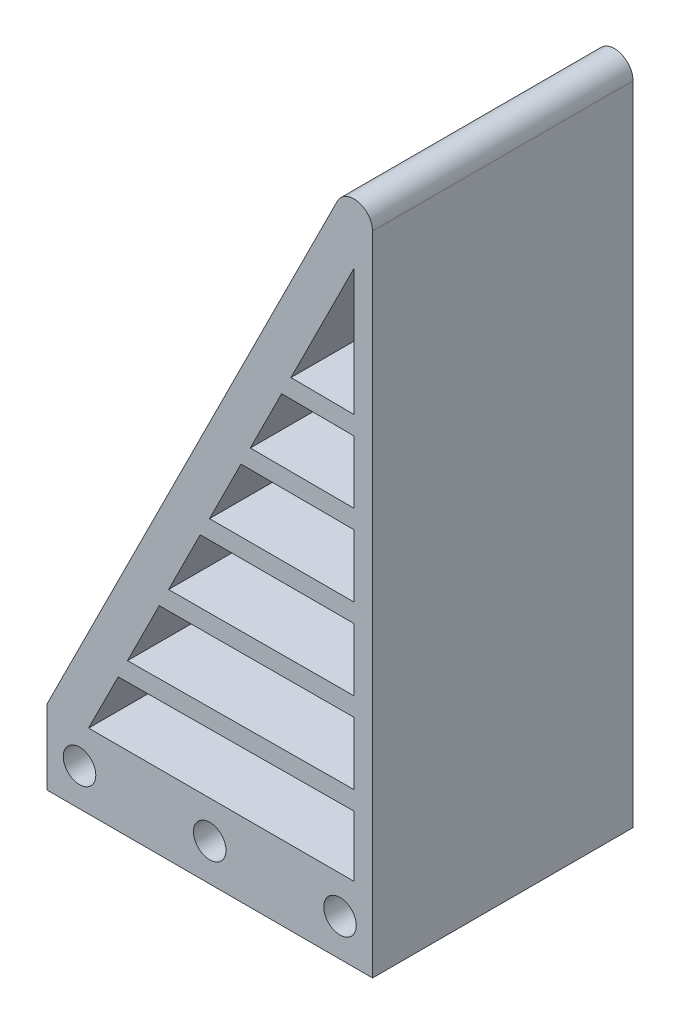
ISO-10303-21;
HEADER;
FILE_DESCRIPTION(('STEP AP214'),'2;1');
FILE_NAME('part.step','',(''),(''),'','','');
FILE_SCHEMA(('AUTOMOTIVE_DESIGN { 1 0 10303 214 1 1 1 1 }'));
ENDSEC;
DATA;
#1=APPLICATION_CONTEXT('core data for automotive mechanical design processes');
#2=APPLICATION_PROTOCOL_DEFINITION('international standard','automotive_design',2000,#1);
#3=PRODUCT_CONTEXT('',#1,'mechanical');
#4=PRODUCT('Part','Part','',(#3));
#5=PRODUCT_RELATED_PRODUCT_CATEGORY('part','',(#4));
#6=PRODUCT_DEFINITION_FORMATION('','',#4);
#7=PRODUCT_DEFINITION_CONTEXT('part definition',#1,'design');
#8=PRODUCT_DEFINITION('design','',#6,#7);
#9=PRODUCT_DEFINITION_SHAPE('','',#8);
#10=(LENGTH_UNIT() NAMED_UNIT(*) SI_UNIT(.MILLI.,.METRE.));
#11=(NAMED_UNIT(*) PLANE_ANGLE_UNIT() SI_UNIT($,.RADIAN.));
#12=(NAMED_UNIT(*) SI_UNIT($,.STERADIAN.) SOLID_ANGLE_UNIT());
#13=UNCERTAINTY_MEASURE_WITH_UNIT(LENGTH_MEASURE(1.E-05),#10,'distance_accuracy_value','');
#14=(GEOMETRIC_REPRESENTATION_CONTEXT(3) GLOBAL_UNCERTAINTY_ASSIGNED_CONTEXT((#13)) GLOBAL_UNIT_ASSIGNED_CONTEXT((#10,
#11,#12)) REPRESENTATION_CONTEXT('',''));
#15=CARTESIAN_POINT('',(0.,0.,0.));
#16=DIRECTION('',(0.,0.,1.));
#17=DIRECTION('',(1.,0.,0.));
#18=AXIS2_PLACEMENT_3D('',#15,#16,#17);
#19=CARTESIAN_POINT('',(15.5,61.0557280900009,0.));
#20=DIRECTION('',(-0.894427190999916,0.447213595499958,0.));
#21=DIRECTION('',(-0.447213595499958,-0.894427190999916,0.));
#22=AXIS2_PLACEMENT_3D('',#19,#20,#21);
#23=PLANE('',#22);
#24=DIRECTION('',(-0.447213595499958,-0.894427190999916,0.));
#25=VECTOR('',#24,1.);
#26=CARTESIAN_POINT('',(15.5,61.0557280900009,28.));
#27=LINE('',#26,#25);
#28=CARTESIAN_POINT('',(15.5,61.0557280900009,28.));
#29=VERTEX_POINT('',#28);
#30=CARTESIAN_POINT('',(8.72607274420883,47.5078735784185,28.));
#31=VERTEX_POINT('',#30);
#32=EDGE_CURVE('E454',#29,#31,#27,.T.);
#33=ORIENTED_EDGE('',*,*,#32,.T.);
#34=DIRECTION('',(0.,0.,1.));
#35=VECTOR('',#34,1.);
#36=CARTESIAN_POINT('',(8.72607274420883,47.5078735784185,-25.439951767214));
#37=LINE('',#36,#35);
#38=CARTESIAN_POINT('',(8.72607274420883,47.5078735784185,0.));
#39=VERTEX_POINT('',#38);
#40=EDGE_CURVE('E827',#39,#31,#37,.T.);
#41=ORIENTED_EDGE('',*,*,#40,.F.);
#42=DIRECTION('',(-0.447213595499958,-0.894427190999916,0.));
#43=VECTOR('',#42,1.);
#44=CARTESIAN_POINT('',(15.5,61.0557280900009,0.));
#45=LINE('',#44,#43);
#46=CARTESIAN_POINT('',(15.5,61.0557280900009,0.));
#47=VERTEX_POINT('',#46);
#48=EDGE_CURVE('E428',#47,#39,#45,.T.);
#49=ORIENTED_EDGE('',*,*,#48,.F.);
#50=DIRECTION('',(0.,0.,1.));
#51=VECTOR('',#50,1.);
#52=CARTESIAN_POINT('',(15.5,61.0557280900009,0.));
#53=LINE('',#52,#51);
#54=EDGE_CURVE('E277',#47,#29,#53,.T.);
#55=ORIENTED_EDGE('',*,*,#54,.T.);
#56=EDGE_LOOP('',(#33,#41,#49,#55));
#57=FACE_BOUND('',#56,.T.);
#58=ADVANCED_FACE('F41',(#57),#23,.F.);
#59=CARTESIAN_POINT('',(15.5,4.,0.));
#60=DIRECTION('',(1.,0.,0.));
#61=DIRECTION('',(0.,0.,-1.));
#62=AXIS2_PLACEMENT_3D('',#59,#60,#61);
#63=PLANE('',#62);
#64=DIRECTION('',(0.,1.,0.));
#65=VECTOR('',#64,1.);
#66=CARTESIAN_POINT('',(15.5,4.,0.));
#67=LINE('',#66,#65);
#68=CARTESIAN_POINT('',(15.5,47.460581876541,0.));
#69=VERTEX_POINT('',#68);
#70=EDGE_CURVE('E247',#69,#47,#67,.T.);
#71=ORIENTED_EDGE('',*,*,#70,.F.);
#72=DIRECTION('',(0.,0.,1.));
#73=VECTOR('',#72,1.);
#74=CARTESIAN_POINT('',(15.5,47.460581876541,-25.439951767214));
#75=LINE('',#74,#73);
#76=CARTESIAN_POINT('',(15.5,47.460581876541,28.));
#77=VERTEX_POINT('',#76);
#78=EDGE_CURVE('E56',#69,#77,#75,.T.);
#79=ORIENTED_EDGE('',*,*,#78,.T.);
#80=DIRECTION('',(0.,1.,0.));
#81=VECTOR('',#80,1.);
#82=CARTESIAN_POINT('',(15.5,4.,28.));
#83=LINE('',#82,#81);
#84=EDGE_CURVE('E443',#77,#29,#83,.T.);
#85=ORIENTED_EDGE('',*,*,#84,.T.);
#86=ORIENTED_EDGE('',*,*,#54,.F.);
#87=EDGE_LOOP('',(#71,#79,#85,#86));
#88=FACE_BOUND('',#87,.T.);
#89=ADVANCED_FACE('F367',(#88),#63,.F.);
#90=CARTESIAN_POINT('',(3.35841025495376,36.7725485999084,28.));
#91=VERTEX_POINT('',#90);
#92=CARTESIAN_POINT('',(-0.0278640450004244,30.,28.));
#93=VERTEX_POINT('',#92);
#94=EDGE_CURVE('E549',#91,#93,#27,.T.);
#95=ORIENTED_EDGE('',*,*,#94,.T.);
#96=DIRECTION('',(0.,0.,1.));
#97=VECTOR('',#96,1.);
#98=CARTESIAN_POINT('',(-0.0278640450004244,30.,-25.439951767214));
#99=LINE('',#98,#97);
#100=CARTESIAN_POINT('',(-0.0278640450004237,30.,0.));
#101=VERTEX_POINT('',#100);
#102=EDGE_CURVE('E476',#101,#93,#99,.T.);
#103=ORIENTED_EDGE('',*,*,#102,.F.);
#104=CARTESIAN_POINT('',(3.35841025495376,36.7725485999084,0.));
#105=VERTEX_POINT('',#104);
#106=EDGE_CURVE('E429',#105,#101,#45,.T.);
#107=ORIENTED_EDGE('',*,*,#106,.F.);
#108=DIRECTION('',(0.,0.,1.));
#109=VECTOR('',#108,1.);
#110=CARTESIAN_POINT('',(3.35841025495376,36.7725485999084,-25.439951767214));
#111=LINE('',#110,#109);
#112=EDGE_CURVE('E494',#105,#91,#111,.T.);
#113=ORIENTED_EDGE('',*,*,#112,.T.);
#114=EDGE_LOOP('',(#95,#103,#107,#113));
#115=FACE_BOUND('',#114,.T.);
#116=ADVANCED_FACE('F370',(#115),#23,.F.);
#117=CARTESIAN_POINT('',(15.5,30.,0.));
#118=VERTEX_POINT('',#117);
#119=CARTESIAN_POINT('',(15.5,36.7301662842743,0.));
#120=VERTEX_POINT('',#119);
#121=EDGE_CURVE('E246',#118,#120,#67,.T.);
#122=ORIENTED_EDGE('',*,*,#121,.F.);
#123=DIRECTION('',(0.,0.,1.));
#124=VECTOR('',#123,1.);
#125=CARTESIAN_POINT('',(15.5,30.,-25.439951767214));
#126=LINE('',#125,#124);
#127=CARTESIAN_POINT('',(15.5,30.,28.));
#128=VERTEX_POINT('',#127);
#129=EDGE_CURVE('E483',#118,#128,#126,.T.);
#130=ORIENTED_EDGE('',*,*,#129,.T.);
#131=CARTESIAN_POINT('',(15.5,36.7301662842743,28.));
#132=VERTEX_POINT('',#131);
#133=EDGE_CURVE('E450',#128,#132,#83,.T.);
#134=ORIENTED_EDGE('',*,*,#133,.T.);
#135=DIRECTION('',(0.,0.,1.));
#136=VECTOR('',#135,1.);
#137=CARTESIAN_POINT('',(15.5,36.7301662842743,-25.439951767214));
#138=LINE('',#137,#136);
#139=EDGE_CURVE('E497',#120,#132,#138,.T.);
#140=ORIENTED_EDGE('',*,*,#139,.F.);
#141=EDGE_LOOP('',(#122,#130,#134,#140));
#142=FACE_BOUND('',#141,.T.);
#143=ADVANCED_FACE('F377',(#142),#63,.F.);
#144=CARTESIAN_POINT('',(7.72952703160204,45.5147821532049,0.));
#145=VERTEX_POINT('',#144);
#146=CARTESIAN_POINT('',(4.35667404126913,38.7690761725391,0.));
#147=VERTEX_POINT('',#146);
#148=EDGE_CURVE('E424',#145,#147,#45,.T.);
#149=ORIENTED_EDGE('',*,*,#148,.F.);
#150=DIRECTION('',(0.,0.,1.));
#151=VECTOR('',#150,1.);
#152=CARTESIAN_POINT('',(7.72952703160203,45.5147821532049,-25.439951767214));
#153=LINE('',#152,#151);
#154=CARTESIAN_POINT('',(7.72952703160203,45.5147821532049,28.));
#155=VERTEX_POINT('',#154);
#156=EDGE_CURVE('E64',#145,#155,#153,.T.);
#157=ORIENTED_EDGE('',*,*,#156,.T.);
#158=CARTESIAN_POINT('',(4.35667404126913,38.7690761725391,28.));
#159=VERTEX_POINT('',#158);
#160=EDGE_CURVE('E550',#155,#159,#27,.T.);
#161=ORIENTED_EDGE('',*,*,#160,.T.);
#162=DIRECTION('',(0.,0.,1.));
#163=VECTOR('',#162,1.);
#164=CARTESIAN_POINT('',(4.35667404126913,38.7690761725391,-25.439951767214));
#165=LINE('',#164,#163);
#166=EDGE_CURVE('E427',#147,#159,#165,.T.);
#167=ORIENTED_EDGE('',*,*,#166,.F.);
#168=EDGE_LOOP('',(#149,#157,#161,#167));
#169=FACE_BOUND('',#168,.T.);
#170=ADVANCED_FACE('F384',(#169),#23,.F.);
#171=CARTESIAN_POINT('',(15.5,38.7301784690329,28.));
#172=VERTEX_POINT('',#171);
#173=CARTESIAN_POINT('',(15.5,45.4605331367641,28.));
#174=VERTEX_POINT('',#173);
#175=EDGE_CURVE('E239',#172,#174,#83,.T.);
#176=ORIENTED_EDGE('',*,*,#175,.T.);
#177=DIRECTION('',(0.,0.,1.));
#178=VECTOR('',#177,1.);
#179=CARTESIAN_POINT('',(15.5,45.4605331367641,-25.439951767214));
#180=LINE('',#179,#178);
#181=CARTESIAN_POINT('',(15.5,45.4605331367641,0.));
#182=VERTEX_POINT('',#181);
#183=EDGE_CURVE('E225',#182,#174,#180,.T.);
#184=ORIENTED_EDGE('',*,*,#183,.F.);
#185=CARTESIAN_POINT('',(15.5,38.7301784690329,0.));
#186=VERTEX_POINT('',#185);
#187=EDGE_CURVE('E237',#186,#182,#67,.T.);
#188=ORIENTED_EDGE('',*,*,#187,.F.);
#189=DIRECTION('',(0.,0.,1.));
#190=VECTOR('',#189,1.);
#191=CARTESIAN_POINT('',(15.5,38.7301784690329,-25.439951767214));
#192=LINE('',#191,#190);
#193=EDGE_CURVE('E499',#186,#172,#192,.T.);
#194=ORIENTED_EDGE('',*,*,#193,.T.);
#195=EDGE_LOOP('',(#176,#184,#188,#194));
#196=FACE_BOUND('',#195,.T.);
#197=ADVANCED_FACE('F235',(#196),#63,.F.);
#198=CARTESIAN_POINT('',(-1.02786404500043,28.,0.));
#199=VERTEX_POINT('',#198);
#200=CARTESIAN_POINT('',(-4.42772777461292,21.200272540775,0.));
#201=VERTEX_POINT('',#200);
#202=EDGE_CURVE('E431',#199,#201,#45,.T.);
#203=ORIENTED_EDGE('',*,*,#202,.F.);
#204=DIRECTION('',(0.,0.,1.));
#205=VECTOR('',#204,1.);
#206=CARTESIAN_POINT('',(-1.02786404500043,28.,-25.439951767214));
#207=LINE('',#206,#205);
#208=CARTESIAN_POINT('',(-1.02786404500043,28.,28.));
#209=VERTEX_POINT('',#208);
#210=EDGE_CURVE('E480',#199,#209,#207,.T.);
#211=ORIENTED_EDGE('',*,*,#210,.T.);
#212=CARTESIAN_POINT('',(-4.42772777461292,21.200272540775,28.));
#213=VERTEX_POINT('',#212);
#214=EDGE_CURVE('E472',#209,#213,#27,.T.);
#215=ORIENTED_EDGE('',*,*,#214,.T.);
#216=DIRECTION('',(0.,0.,1.));
#217=VECTOR('',#216,1.);
#218=CARTESIAN_POINT('',(-4.42772777461292,21.200272540775,-25.439951767214));
#219=LINE('',#218,#217);
#220=EDGE_CURVE('E511',#201,#213,#219,.T.);
#221=ORIENTED_EDGE('',*,*,#220,.F.);
#222=EDGE_LOOP('',(#203,#211,#215,#221));
#223=FACE_BOUND('',#222,.T.);
#224=ADVANCED_FACE('F403',(#223),#23,.F.);
#225=CARTESIAN_POINT('',(15.5,21.269833715724,28.));
#226=VERTEX_POINT('',#225);
#227=CARTESIAN_POINT('',(15.5,28.,28.));
#228=VERTEX_POINT('',#227);
#229=EDGE_CURVE('E447',#226,#228,#83,.T.);
#230=ORIENTED_EDGE('',*,*,#229,.T.);
#231=DIRECTION('',(0.,0.,1.));
#232=VECTOR('',#231,1.);
#233=CARTESIAN_POINT('',(15.5,28.,-25.439951767214));
#234=LINE('',#233,#232);
#235=CARTESIAN_POINT('',(15.5,28.,0.));
#236=VERTEX_POINT('',#235);
#237=EDGE_CURVE('E463',#236,#228,#234,.T.);
#238=ORIENTED_EDGE('',*,*,#237,.F.);
#239=CARTESIAN_POINT('',(15.5,21.269833715724,0.));
#240=VERTEX_POINT('',#239);
#241=EDGE_CURVE('E249',#240,#236,#67,.T.);
#242=ORIENTED_EDGE('',*,*,#241,.F.);
#243=DIRECTION('',(0.,0.,1.));
#244=VECTOR('',#243,1.);
#245=CARTESIAN_POINT('',(15.5,21.269833715724,-25.439951767214));
#246=LINE('',#245,#244);
#247=EDGE_CURVE('E464',#240,#226,#246,.T.);
#248=ORIENTED_EDGE('',*,*,#247,.T.);
#249=EDGE_LOOP('',(#230,#238,#242,#248));
#250=FACE_BOUND('',#249,.T.);
#251=ADVANCED_FACE('F401',(#250),#63,.F.);
#252=CARTESIAN_POINT('',(-5.42948226550976,19.1967635589813,0.));
#253=VERTEX_POINT('',#252);
#254=CARTESIAN_POINT('',(-8.84310546200584,12.3695171659892,0.));
#255=VERTEX_POINT('',#254);
#256=EDGE_CURVE('E435',#253,#255,#45,.T.);
#257=ORIENTED_EDGE('',*,*,#256,.F.);
#258=DIRECTION('',(0.,0.,1.));
#259=VECTOR('',#258,1.);
#260=CARTESIAN_POINT('',(-5.42948226550976,19.1967635589813,-25.439951767214));
#261=LINE('',#260,#259);
#262=CARTESIAN_POINT('',(-5.42948226550976,19.1967635589813,28.));
#263=VERTEX_POINT('',#262);
#264=EDGE_CURVE('E515',#253,#263,#261,.T.);
#265=ORIENTED_EDGE('',*,*,#264,.T.);
#266=CARTESIAN_POINT('',(-8.84310546200584,12.3695171659892,28.));
#267=VERTEX_POINT('',#266);
#268=EDGE_CURVE('E547',#263,#267,#27,.T.);
#269=ORIENTED_EDGE('',*,*,#268,.T.);
#270=DIRECTION('',(0.,0.,1.));
#271=VECTOR('',#270,1.);
#272=CARTESIAN_POINT('',(-8.84310546200584,12.3695171659892,-25.439951767214));
#273=LINE('',#272,#271);
#274=EDGE_CURVE('E531',#255,#267,#273,.T.);
#275=ORIENTED_EDGE('',*,*,#274,.F.);
#276=EDGE_LOOP('',(#257,#265,#269,#275));
#277=FACE_BOUND('',#276,.T.);
#278=ADVANCED_FACE('F388',(#277),#23,.F.);
#279=CARTESIAN_POINT('',(15.5,12.5394668632342,28.));
#280=VERTEX_POINT('',#279);
#281=CARTESIAN_POINT('',(15.5,19.2698215309653,28.));
#282=VERTEX_POINT('',#281);
#283=EDGE_CURVE('E441',#280,#282,#83,.T.);
#284=ORIENTED_EDGE('',*,*,#283,.T.);
#285=DIRECTION('',(0.,0.,1.));
#286=VECTOR('',#285,1.);
#287=CARTESIAN_POINT('',(15.5,19.2698215309653,-25.439951767214));
#288=LINE('',#287,#286);
#289=CARTESIAN_POINT('',(15.5,19.2698215309653,0.));
#290=VERTEX_POINT('',#289);
#291=EDGE_CURVE('E518',#290,#282,#288,.T.);
#292=ORIENTED_EDGE('',*,*,#291,.F.);
#293=CARTESIAN_POINT('',(15.5,12.5394668632342,0.));
#294=VERTEX_POINT('',#293);
#295=EDGE_CURVE('E255',#294,#290,#67,.T.);
#296=ORIENTED_EDGE('',*,*,#295,.F.);
#297=DIRECTION('',(0.,0.,1.));
#298=VECTOR('',#297,1.);
#299=CARTESIAN_POINT('',(15.5,12.5394668632342,-25.439951767214));
#300=LINE('',#299,#298);
#301=EDGE_CURVE('E540',#294,#280,#300,.T.);
#302=ORIENTED_EDGE('',*,*,#301,.T.);
#303=EDGE_LOOP('',(#284,#292,#296,#302));
#304=FACE_BOUND('',#303,.T.);
#305=ADVANCED_FACE('F395',(#304),#63,.F.);
#306=CARTESIAN_POINT('',(17.5,0.,28.));
#307=DIRECTION('',(-1.,0.,0.));
#308=DIRECTION('',(0.,0.,1.));
#309=AXIS2_PLACEMENT_3D('',#306,#307,#308);
#310=PLANE('',#309);
#311=DIRECTION('',(0.,1.,0.));
#312=VECTOR('',#311,1.);
#313=CARTESIAN_POINT('',(17.5,0.,0.));
#314=LINE('',#313,#312);
#315=CARTESIAN_POINT('',(17.5,-4.,0.));
#316=VERTEX_POINT('',#315);
#317=CARTESIAN_POINT('',(17.5,65.5278640450004,0.));
#318=VERTEX_POINT('',#317);
#319=EDGE_CURVE('E297',#316,#318,#314,.T.);
#320=ORIENTED_EDGE('',*,*,#319,.T.);
#321=DIRECTION('',(0.,0.,-1.));
#322=VECTOR('',#321,1.);
#323=CARTESIAN_POINT('',(17.5,65.5278640450004,28.));
#324=LINE('',#323,#322);
#325=CARTESIAN_POINT('',(17.5,65.5278640450004,28.));
#326=VERTEX_POINT('',#325);
#327=EDGE_CURVE('E49',#318,#326,#324,.F.);
#328=ORIENTED_EDGE('',*,*,#327,.T.);
#329=DIRECTION('',(0.,1.,0.));
#330=VECTOR('',#329,1.);
#331=CARTESIAN_POINT('',(17.5,0.,28.));
#332=LINE('',#331,#330);
#333=CARTESIAN_POINT('',(17.5,-4.,28.));
#334=VERTEX_POINT('',#333);
#335=EDGE_CURVE('E300',#334,#326,#332,.T.);
#336=ORIENTED_EDGE('',*,*,#335,.F.);
#337=DIRECTION('',(0.,0.,-1.));
#338=VECTOR('',#337,1.);
#339=CARTESIAN_POINT('',(17.5,-4.,28.));
#340=LINE('',#339,#338);
#341=EDGE_CURVE('E311',#334,#316,#340,.T.);
#342=ORIENTED_EDGE('',*,*,#341,.T.);
#343=EDGE_LOOP('',(#320,#328,#336,#342));
#344=FACE_BOUND('',#343,.T.);
#345=ADVANCED_FACE('F334',(#344),#310,.F.);
#346=CARTESIAN_POINT('',(-15.6,7.8,28.));
#347=DIRECTION('',(0.894427190999916,-0.447213595499958,0.));
#348=DIRECTION('',(0.447213595499958,0.894427190999916,0.));
#349=AXIS2_PLACEMENT_3D('',#346,#347,#348);
#350=PLANE('',#349);
#351=DIRECTION('',(-0.447213595499958,-0.894427190999916,0.));
#352=VECTOR('',#351,1.);
#353=CARTESIAN_POINT('',(-15.6,7.8,28.));
#354=LINE('',#353,#352);
#355=CARTESIAN_POINT('',(13.7111456180002,66.4222912360004,28.));
#356=VERTEX_POINT('',#355);
#357=CARTESIAN_POINT('',(-17.5,4.,28.));
#358=VERTEX_POINT('',#357);
#359=EDGE_CURVE('E303',#356,#358,#354,.T.);
#360=ORIENTED_EDGE('',*,*,#359,.F.);
#361=DIRECTION('',(0.,0.,-1.));
#362=VECTOR('',#361,1.);
#363=CARTESIAN_POINT('',(13.7111456180002,66.4222912360003,28.));
#364=LINE('',#363,#362);
#365=CARTESIAN_POINT('',(13.7111456180002,66.4222912360004,0.));
#366=VERTEX_POINT('',#365);
#367=EDGE_CURVE('E327',#356,#366,#364,.T.);
#368=ORIENTED_EDGE('',*,*,#367,.T.);
#369=DIRECTION('',(-0.447213595499958,-0.894427190999916,0.));
#370=VECTOR('',#369,1.);
#371=CARTESIAN_POINT('',(-15.6,7.8,0.));
#372=LINE('',#371,#370);
#373=CARTESIAN_POINT('',(-17.5,4.,0.));
#374=VERTEX_POINT('',#373);
#375=EDGE_CURVE('E314',#366,#374,#372,.T.);
#376=ORIENTED_EDGE('',*,*,#375,.T.);
#377=DIRECTION('',(0.,0.,-1.));
#378=VECTOR('',#377,1.);
#379=CARTESIAN_POINT('',(-17.5,4.,28.));
#380=LINE('',#379,#378);
#381=EDGE_CURVE('E324',#358,#374,#380,.T.);
#382=ORIENTED_EDGE('',*,*,#381,.F.);
#383=EDGE_LOOP('',(#360,#368,#376,#382));
#384=FACE_BOUND('',#383,.T.);
#385=ADVANCED_FACE('F347',(#384),#350,.F.);
#386=CARTESIAN_POINT('',(-17.5,0.,28.));
#387=DIRECTION('',(-1.,0.,0.));
#388=DIRECTION('',(0.,0.,1.));
#389=AXIS2_PLACEMENT_3D('',#386,#387,#388);
#390=PLANE('',#389);
#391=DIRECTION('',(0.,1.,0.));
#392=VECTOR('',#391,1.);
#393=CARTESIAN_POINT('',(-17.5,0.,0.));
#394=LINE('',#393,#392);
#395=CARTESIAN_POINT('',(-17.5,-4.,0.));
#396=VERTEX_POINT('',#395);
#397=EDGE_CURVE('E316',#396,#374,#394,.T.);
#398=ORIENTED_EDGE('',*,*,#397,.F.);
#399=DIRECTION('',(0.,0.,-1.));
#400=VECTOR('',#399,1.);
#401=CARTESIAN_POINT('',(-17.5,-4.,28.));
#402=LINE('',#401,#400);
#403=CARTESIAN_POINT('',(-17.5,-4.,28.));
#404=VERTEX_POINT('',#403);
#405=EDGE_CURVE('E322',#404,#396,#402,.T.);
#406=ORIENTED_EDGE('',*,*,#405,.F.);
#407=DIRECTION('',(0.,1.,0.));
#408=VECTOR('',#407,1.);
#409=CARTESIAN_POINT('',(-17.5,0.,28.));
#410=LINE('',#409,#408);
#411=EDGE_CURVE('E306',#404,#358,#410,.T.);
#412=ORIENTED_EDGE('',*,*,#411,.T.);
#413=ORIENTED_EDGE('',*,*,#381,.T.);
#414=EDGE_LOOP('',(#398,#406,#412,#413));
#415=FACE_BOUND('',#414,.T.);
#416=ADVANCED_FACE('F353',(#415),#390,.T.);
#417=CARTESIAN_POINT('',(0.,-4.,28.));
#418=DIRECTION('',(0.,1.,0.));
#419=DIRECTION('',(0.,0.,1.));
#420=AXIS2_PLACEMENT_3D('',#417,#418,#419);
#421=PLANE('',#420);
#422=DIRECTION('',(1.,0.,0.));
#423=VECTOR('',#422,1.);
#424=CARTESIAN_POINT('',(0.,-4.,0.));
#425=LINE('',#424,#423);
#426=EDGE_CURVE('E304',#396,#316,#425,.T.);
#427=ORIENTED_EDGE('',*,*,#426,.T.);
#428=ORIENTED_EDGE('',*,*,#341,.F.);
#429=DIRECTION('',(1.,0.,0.));
#430=VECTOR('',#429,1.);
#431=CARTESIAN_POINT('',(0.,-4.,28.));
#432=LINE('',#431,#430);
#433=EDGE_CURVE('E309',#404,#334,#432,.T.);
#434=ORIENTED_EDGE('',*,*,#433,.F.);
#435=ORIENTED_EDGE('',*,*,#405,.T.);
#436=EDGE_LOOP('',(#427,#428,#434,#435));
#437=FACE_BOUND('',#436,.T.);
#438=ADVANCED_FACE('F355',(#437),#421,.F.);
#439=CARTESIAN_POINT('',(0.,0.,28.));
#440=DIRECTION('',(0.,0.,1.));
#441=DIRECTION('',(1.,0.,0.));
#442=AXIS2_PLACEMENT_3D('',#439,#440,#441);
#443=PLANE('',#442);
#444=ORIENTED_EDGE('',*,*,#84,.F.);
#445=DIRECTION('',(-0.999975630705395,0.00698126029795395,0.));
#446=VECTOR('',#445,1.);
#447=CARTESIAN_POINT('',(15.5,47.460581876541,28.));
#448=LINE('',#447,#446);
#449=EDGE_CURVE('E490',#77,#31,#448,.T.);
#450=ORIENTED_EDGE('',*,*,#449,.T.);
#451=ORIENTED_EDGE('',*,*,#32,.F.);
#452=EDGE_LOOP('',(#444,#450,#451));
#453=FACE_BOUND('',#452,.T.);
#454=ORIENTED_EDGE('',*,*,#133,.F.);
#455=DIRECTION('',(-1.,0.,0.));
#456=VECTOR('',#455,1.);
#457=CARTESIAN_POINT('',(15.5,30.,28.));
#458=LINE('',#457,#456);
#459=EDGE_CURVE('E475',#128,#93,#458,.T.);
#460=ORIENTED_EDGE('',*,*,#459,.T.);
#461=ORIENTED_EDGE('',*,*,#94,.F.);
#462=DIRECTION('',(0.99999390765779,-0.00349065141521605,0.));
#463=VECTOR('',#462,1.);
#464=CARTESIAN_POINT('',(3.35841025495376,36.7725485999084,28.));
#465=LINE('',#464,#463);
#466=EDGE_CURVE('E493',#91,#132,#465,.T.);
#467=ORIENTED_EDGE('',*,*,#466,.T.);
#468=EDGE_LOOP('',(#454,#460,#461,#467));
#469=FACE_BOUND('',#468,.T.);
#470=ORIENTED_EDGE('',*,*,#175,.F.);
#471=DIRECTION('',(-0.99999390765779,0.00349065141521617,0.));
#472=VECTOR('',#471,1.);
#473=CARTESIAN_POINT('',(15.5,38.7301784690329,28.));
#474=LINE('',#473,#472);
#475=EDGE_CURVE('E504',#172,#159,#474,.T.);
#476=ORIENTED_EDGE('',*,*,#475,.T.);
#477=ORIENTED_EDGE('',*,*,#160,.F.);
#478=DIRECTION('',(0.999975630705395,-0.00698126029795356,0.));
#479=VECTOR('',#478,1.);
#480=CARTESIAN_POINT('',(7.72952703160203,45.5147821532049,28.));
#481=LINE('',#480,#479);
#482=EDGE_CURVE('E831',#155,#174,#481,.T.);
#483=ORIENTED_EDGE('',*,*,#482,.T.);
#484=EDGE_LOOP('',(#470,#476,#477,#483));
#485=FACE_BOUND('',#484,.T.);
#486=ORIENTED_EDGE('',*,*,#229,.F.);
#487=DIRECTION('',(-0.99999390765779,-0.00349065141521707,0.));
#488=VECTOR('',#487,1.);
#489=CARTESIAN_POINT('',(-4.42772777461292,21.200272540775,28.));
#490=LINE('',#489,#488);
#491=EDGE_CURVE('E470',#226,#213,#490,.T.);
#492=ORIENTED_EDGE('',*,*,#491,.T.);
#493=ORIENTED_EDGE('',*,*,#214,.F.);
#494=DIRECTION('',(1.,0.,0.));
#495=VECTOR('',#494,1.);
#496=CARTESIAN_POINT('',(-1.02786404500043,28.,28.));
#497=LINE('',#496,#495);
#498=EDGE_CURVE('E471',#209,#228,#497,.T.);
#499=ORIENTED_EDGE('',*,*,#498,.T.);
#500=EDGE_LOOP('',(#486,#492,#493,#499));
#501=FACE_BOUND('',#500,.T.);
#502=CARTESIAN_POINT('',(-9.8466328602523,10.3624623694963,28.));
#503=VERTEX_POINT('',#502);
#504=CARTESIAN_POINT('',(-13.0278640450004,4.,28.));
#505=VERTEX_POINT('',#504);
#506=EDGE_CURVE('E546',#503,#505,#27,.T.);
#507=ORIENTED_EDGE('',*,*,#506,.F.);
#508=DIRECTION('',(0.999975630705395,0.00698126029795446,0.));
#509=VECTOR('',#508,1.);
#510=CARTESIAN_POINT('',(15.5,10.5394181234573,28.));
#511=LINE('',#510,#509);
#512=CARTESIAN_POINT('',(15.5,10.5394181234573,28.));
#513=VERTEX_POINT('',#512);
#514=EDGE_CURVE('E525',#503,#513,#511,.T.);
#515=ORIENTED_EDGE('',*,*,#514,.T.);
#516=CARTESIAN_POINT('',(15.5,4.,28.));
#517=VERTEX_POINT('',#516);
#518=EDGE_CURVE('E439',#517,#513,#83,.T.);
#519=ORIENTED_EDGE('',*,*,#518,.F.);
#520=DIRECTION('',(1.,0.,0.));
#521=VECTOR('',#520,1.);
#522=CARTESIAN_POINT('',(-13.0278640450004,4.,28.));
#523=LINE('',#522,#521);
#524=EDGE_CURVE('E449',#505,#517,#523,.T.);
#525=ORIENTED_EDGE('',*,*,#524,.F.);
#526=EDGE_LOOP('',(#507,#515,#519,#525));
#527=FACE_BOUND('',#526,.T.);
#528=DIRECTION('',(0.999993907657791,0.00349065141521694,0.));
#529=VECTOR('',#528,1.);
#530=CARTESIAN_POINT('',(15.5,19.2698215309653,28.));
#531=LINE('',#530,#529);
#532=EDGE_CURVE('E514',#263,#282,#531,.T.);
#533=ORIENTED_EDGE('',*,*,#532,.T.);
#534=ORIENTED_EDGE('',*,*,#283,.F.);
#535=DIRECTION('',(-0.999975630705395,-0.00698126029795472,0.));
#536=VECTOR('',#535,1.);
#537=CARTESIAN_POINT('',(-8.84310546200584,12.3695171659892,28.));
#538=LINE('',#537,#536);
#539=EDGE_CURVE('E534',#280,#267,#538,.T.);
#540=ORIENTED_EDGE('',*,*,#539,.T.);
#541=ORIENTED_EDGE('',*,*,#268,.F.);
#542=EDGE_LOOP('',(#533,#534,#540,#541));
#543=FACE_BOUND('',#542,.T.);
#544=CARTESIAN_POINT('',(14.,0.,28.));
#545=DIRECTION('',(0.,0.,1.));
#546=DIRECTION('',(1.,0.,0.));
#547=AXIS2_PLACEMENT_3D('',#544,#545,#546);
#548=CIRCLE('',#547,1.75);
#549=CARTESIAN_POINT('',(15.75,0.,28.));
#550=VERTEX_POINT('',#549);
#551=EDGE_CURVE('E288',#550,#550,#548,.T.);
#552=ORIENTED_EDGE('',*,*,#551,.F.);
#553=EDGE_LOOP('',(#552));
#554=FACE_BOUND('',#553,.T.);
#555=CARTESIAN_POINT('',(-14.,0.,28.));
#556=DIRECTION('',(0.,0.,1.));
#557=DIRECTION('',(1.,0.,0.));
#558=AXIS2_PLACEMENT_3D('',#555,#556,#557);
#559=CIRCLE('',#558,1.75);
#560=CARTESIAN_POINT('',(-12.25,0.,28.));
#561=VERTEX_POINT('',#560);
#562=EDGE_CURVE('E281',#561,#561,#559,.T.);
#563=ORIENTED_EDGE('',*,*,#562,.F.);
#564=EDGE_LOOP('',(#563));
#565=FACE_BOUND('',#564,.T.);
#566=CARTESIAN_POINT('',(0.,0.,28.));
#567=DIRECTION('',(0.,0.,1.));
#568=DIRECTION('',(1.,0.,0.));
#569=AXIS2_PLACEMENT_3D('',#566,#567,#568);
#570=CIRCLE('',#569,1.75);
#571=CARTESIAN_POINT('',(1.75,0.,28.));
#572=VERTEX_POINT('',#571);
#573=EDGE_CURVE('E284',#572,#572,#570,.T.);
#574=ORIENTED_EDGE('',*,*,#573,.F.);
#575=EDGE_LOOP('',(#574));
#576=FACE_BOUND('',#575,.T.);
#577=ORIENTED_EDGE('',*,*,#335,.T.);
#578=CARTESIAN_POINT('',(15.5,65.5278640450004,28.));
#579=DIRECTION('',(0.,0.,1.));
#580=DIRECTION('',(1.,0.,0.));
#581=AXIS2_PLACEMENT_3D('',#578,#579,#580);
#582=CIRCLE('',#581,2.);
#583=EDGE_CURVE('E11',#326,#356,#582,.T.);
#584=ORIENTED_EDGE('',*,*,#583,.T.);
#585=ORIENTED_EDGE('',*,*,#359,.T.);
#586=ORIENTED_EDGE('',*,*,#411,.F.);
#587=ORIENTED_EDGE('',*,*,#433,.T.);
#588=EDGE_LOOP('',(#577,#584,#585,#586,#587));
#589=FACE_BOUND('',#588,.T.);
#590=ADVANCED_FACE('F339',(#453,#469,#485,#501,#527,#543,#554,#565,#576,#589),#443,.T.);
#591=CARTESIAN_POINT('',(0.,0.,0.));
#592=DIRECTION('',(0.,0.,1.));
#593=DIRECTION('',(1.,0.,0.));
#594=AXIS2_PLACEMENT_3D('',#591,#592,#593);
#595=PLANE('',#594);
#596=ORIENTED_EDGE('',*,*,#187,.T.);
#597=DIRECTION('',(-0.999975630705395,0.00698126029795356,0.));
#598=VECTOR('',#597,1.);
#599=CARTESIAN_POINT('',(7.72952703160203,45.5147821532049,0.));
#600=LINE('',#599,#598);
#601=EDGE_CURVE('E222',#182,#145,#600,.T.);
#602=ORIENTED_EDGE('',*,*,#601,.T.);
#603=ORIENTED_EDGE('',*,*,#148,.T.);
#604=DIRECTION('',(0.99999390765779,-0.00349065141521617,0.));
#605=VECTOR('',#604,1.);
#606=CARTESIAN_POINT('',(15.5,38.7301784690329,0.));
#607=LINE('',#606,#605);
#608=EDGE_CURVE('E245',#147,#186,#607,.T.);
#609=ORIENTED_EDGE('',*,*,#608,.T.);
#610=EDGE_LOOP('',(#596,#602,#603,#609));
#611=FACE_BOUND('',#610,.T.);
#612=ORIENTED_EDGE('',*,*,#241,.T.);
#613=DIRECTION('',(-1.,0.,0.));
#614=VECTOR('',#613,1.);
#615=CARTESIAN_POINT('',(-1.02786404500043,28.,0.));
#616=LINE('',#615,#614);
#617=EDGE_CURVE('E489',#236,#199,#616,.T.);
#618=ORIENTED_EDGE('',*,*,#617,.T.);
#619=ORIENTED_EDGE('',*,*,#202,.T.);
#620=DIRECTION('',(0.99999390765779,0.00349065141521707,0.));
#621=VECTOR('',#620,1.);
#622=CARTESIAN_POINT('',(-4.42772777461292,21.200272540775,0.));
#623=LINE('',#622,#621);
#624=EDGE_CURVE('E507',#201,#240,#623,.T.);
#625=ORIENTED_EDGE('',*,*,#624,.T.);
#626=EDGE_LOOP('',(#612,#618,#619,#625));
#627=FACE_BOUND('',#626,.T.);
#628=DIRECTION('',(1.,0.,0.));
#629=VECTOR('',#628,1.);
#630=CARTESIAN_POINT('',(15.5,30.,0.));
#631=LINE('',#630,#629);
#632=EDGE_CURVE('E486',#101,#118,#631,.T.);
#633=ORIENTED_EDGE('',*,*,#632,.T.);
#634=ORIENTED_EDGE('',*,*,#121,.T.);
#635=DIRECTION('',(-0.99999390765779,0.00349065141521605,0.));
#636=VECTOR('',#635,1.);
#637=CARTESIAN_POINT('',(3.35841025495376,36.7725485999084,0.));
#638=LINE('',#637,#636);
#639=EDGE_CURVE('E501',#120,#105,#638,.T.);
#640=ORIENTED_EDGE('',*,*,#639,.T.);
#641=ORIENTED_EDGE('',*,*,#106,.T.);
#642=EDGE_LOOP('',(#633,#634,#640,#641));
#643=FACE_BOUND('',#642,.T.);
#644=ORIENTED_EDGE('',*,*,#295,.T.);
#645=DIRECTION('',(-0.99999390765779,-0.00349065141521694,0.));
#646=VECTOR('',#645,1.);
#647=CARTESIAN_POINT('',(15.5,19.2698215309653,0.));
#648=LINE('',#647,#646);
#649=EDGE_CURVE('E521',#290,#253,#648,.T.);
#650=ORIENTED_EDGE('',*,*,#649,.T.);
#651=ORIENTED_EDGE('',*,*,#256,.T.);
#652=DIRECTION('',(0.999975630705395,0.00698126029795472,0.));
#653=VECTOR('',#652,1.);
#654=CARTESIAN_POINT('',(-8.84310546200584,12.3695171659892,0.));
#655=LINE('',#654,#653);
#656=EDGE_CURVE('E528',#255,#294,#655,.T.);
#657=ORIENTED_EDGE('',*,*,#656,.T.);
#658=EDGE_LOOP('',(#644,#650,#651,#657));
#659=FACE_BOUND('',#658,.T.);
#660=ORIENTED_EDGE('',*,*,#48,.T.);
#661=DIRECTION('',(0.999975630705395,-0.00698126029795394,0.));
#662=VECTOR('',#661,1.);
#663=CARTESIAN_POINT('',(15.5,47.460581876541,0.));
#664=LINE('',#663,#662);
#665=EDGE_CURVE('E230',#39,#69,#664,.T.);
#666=ORIENTED_EDGE('',*,*,#665,.T.);
#667=ORIENTED_EDGE('',*,*,#70,.T.);
#668=EDGE_LOOP('',(#660,#666,#667));
#669=FACE_BOUND('',#668,.T.);
#670=CARTESIAN_POINT('',(15.5,4.,0.));
#671=VERTEX_POINT('',#670);
#672=CARTESIAN_POINT('',(15.5,10.5394181234573,0.));
#673=VERTEX_POINT('',#672);
#674=EDGE_CURVE('E251',#671,#673,#67,.T.);
#675=ORIENTED_EDGE('',*,*,#674,.T.);
#676=DIRECTION('',(-0.999975630705395,-0.00698126029795446,0.));
#677=VECTOR('',#676,1.);
#678=CARTESIAN_POINT('',(15.5,10.5394181234573,0.));
#679=LINE('',#678,#677);
#680=CARTESIAN_POINT('',(-9.84663286025229,10.3624623694963,0.));
#681=VERTEX_POINT('',#680);
#682=EDGE_CURVE('E530',#673,#681,#679,.T.);
#683=ORIENTED_EDGE('',*,*,#682,.T.);
#684=CARTESIAN_POINT('',(-13.0278640450004,4.,0.));
#685=VERTEX_POINT('',#684);
#686=EDGE_CURVE('E433',#681,#685,#45,.T.);
#687=ORIENTED_EDGE('',*,*,#686,.T.);
#688=DIRECTION('',(1.,0.,0.));
#689=VECTOR('',#688,1.);
#690=CARTESIAN_POINT('',(-13.0278640450004,4.,0.));
#691=LINE('',#690,#689);
#692=EDGE_CURVE('E250',#685,#671,#691,.T.);
#693=ORIENTED_EDGE('',*,*,#692,.T.);
#694=EDGE_LOOP('',(#675,#683,#687,#693));
#695=FACE_BOUND('',#694,.T.);
#696=CARTESIAN_POINT('',(14.,0.,0.));
#697=DIRECTION('',(0.,0.,1.));
#698=DIRECTION('',(1.,0.,0.));
#699=AXIS2_PLACEMENT_3D('',#696,#697,#698);
#700=CIRCLE('',#699,1.75);
#701=CARTESIAN_POINT('',(15.75,0.,0.));
#702=VERTEX_POINT('',#701);
#703=EDGE_CURVE('E291',#702,#702,#700,.T.);
#704=ORIENTED_EDGE('',*,*,#703,.T.);
#705=EDGE_LOOP('',(#704));
#706=FACE_BOUND('',#705,.T.);
#707=CARTESIAN_POINT('',(-14.,0.,0.));
#708=DIRECTION('',(0.,0.,1.));
#709=DIRECTION('',(1.,0.,0.));
#710=AXIS2_PLACEMENT_3D('',#707,#708,#709);
#711=CIRCLE('',#710,1.75);
#712=CARTESIAN_POINT('',(-12.25,0.,0.));
#713=VERTEX_POINT('',#712);
#714=EDGE_CURVE('E285',#713,#713,#711,.T.);
#715=ORIENTED_EDGE('',*,*,#714,.T.);
#716=EDGE_LOOP('',(#715));
#717=FACE_BOUND('',#716,.T.);
#718=CARTESIAN_POINT('',(0.,0.,0.));
#719=DIRECTION('',(0.,0.,1.));
#720=DIRECTION('',(1.,0.,0.));
#721=AXIS2_PLACEMENT_3D('',#718,#719,#720);
#722=CIRCLE('',#721,1.75);
#723=CARTESIAN_POINT('',(1.75,0.,0.));
#724=VERTEX_POINT('',#723);
#725=EDGE_CURVE('E294',#724,#724,#722,.T.);
#726=ORIENTED_EDGE('',*,*,#725,.T.);
#727=EDGE_LOOP('',(#726));
#728=FACE_BOUND('',#727,.T.);
#729=ORIENTED_EDGE('',*,*,#375,.F.);
#730=CARTESIAN_POINT('',(15.5,65.5278640450004,0.));
#731=DIRECTION('',(0.,0.,1.));
#732=DIRECTION('',(1.,0.,0.));
#733=AXIS2_PLACEMENT_3D('',#730,#731,#732);
#734=CIRCLE('',#733,2.);
#735=EDGE_CURVE('E330',#366,#318,#734,.F.);
#736=ORIENTED_EDGE('',*,*,#735,.T.);
#737=ORIENTED_EDGE('',*,*,#319,.F.);
#738=ORIENTED_EDGE('',*,*,#426,.F.);
#739=ORIENTED_EDGE('',*,*,#397,.T.);
#740=EDGE_LOOP('',(#729,#736,#737,#738,#739));
#741=FACE_BOUND('',#740,.T.);
#742=ADVANCED_FACE('F242',(#611,#627,#643,#659,#669,#695,#706,#717,#728,#741),#595,.F.);
#743=CARTESIAN_POINT('',(0.,0.,0.));
#744=DIRECTION('',(0.,0.,1.));
#745=DIRECTION('',(1.,0.,0.));
#746=AXIS2_PLACEMENT_3D('',#743,#744,#745);
#747=CYLINDRICAL_SURFACE('',#746,1.75);
#748=ORIENTED_EDGE('',*,*,#725,.F.);
#749=EDGE_LOOP('',(#748));
#750=FACE_BOUND('',#749,.T.);
#751=ORIENTED_EDGE('',*,*,#573,.T.);
#752=EDGE_LOOP('',(#751));
#753=FACE_BOUND('',#752,.T.);
#754=ADVANCED_FACE('F559',(#750,#753),#747,.F.);
#755=CARTESIAN_POINT('',(-14.,0.,0.));
#756=DIRECTION('',(0.,0.,1.));
#757=DIRECTION('',(1.,0.,0.));
#758=AXIS2_PLACEMENT_3D('',#755,#756,#757);
#759=CYLINDRICAL_SURFACE('',#758,1.75);
#760=ORIENTED_EDGE('',*,*,#714,.F.);
#761=EDGE_LOOP('',(#760));
#762=FACE_BOUND('',#761,.T.);
#763=ORIENTED_EDGE('',*,*,#562,.T.);
#764=EDGE_LOOP('',(#763));
#765=FACE_BOUND('',#764,.T.);
#766=ADVANCED_FACE('F396',(#762,#765),#759,.F.);
#767=CARTESIAN_POINT('',(14.,0.,0.));
#768=DIRECTION('',(0.,0.,1.));
#769=DIRECTION('',(1.,0.,0.));
#770=AXIS2_PLACEMENT_3D('',#767,#768,#769);
#771=CYLINDRICAL_SURFACE('',#770,1.75);
#772=ORIENTED_EDGE('',*,*,#703,.F.);
#773=EDGE_LOOP('',(#772));
#774=FACE_BOUND('',#773,.T.);
#775=ORIENTED_EDGE('',*,*,#551,.T.);
#776=EDGE_LOOP('',(#775));
#777=FACE_BOUND('',#776,.T.);
#778=ADVANCED_FACE('F386',(#774,#777),#771,.F.);
#779=ORIENTED_EDGE('',*,*,#686,.F.);
#780=DIRECTION('',(0.,0.,1.));
#781=VECTOR('',#780,1.);
#782=CARTESIAN_POINT('',(-9.8466328602523,10.3624623694963,-25.439951767214));
#783=LINE('',#782,#781);
#784=EDGE_CURVE('E537',#681,#503,#783,.T.);
#785=ORIENTED_EDGE('',*,*,#784,.T.);
#786=ORIENTED_EDGE('',*,*,#506,.T.);
#787=DIRECTION('',(0.,0.,1.));
#788=VECTOR('',#787,1.);
#789=CARTESIAN_POINT('',(-13.0278640450004,4.,0.));
#790=LINE('',#789,#788);
#791=EDGE_CURVE('E265',#685,#505,#790,.T.);
#792=ORIENTED_EDGE('',*,*,#791,.F.);
#793=EDGE_LOOP('',(#779,#785,#786,#792));
#794=FACE_BOUND('',#793,.T.);
#795=ADVANCED_FACE('F371',(#794),#23,.F.);
#796=ORIENTED_EDGE('',*,*,#518,.T.);
#797=DIRECTION('',(0.,0.,1.));
#798=VECTOR('',#797,1.);
#799=CARTESIAN_POINT('',(15.5,10.5394181234573,-25.439951767214));
#800=LINE('',#799,#798);
#801=EDGE_CURVE('E543',#673,#513,#800,.T.);
#802=ORIENTED_EDGE('',*,*,#801,.F.);
#803=ORIENTED_EDGE('',*,*,#674,.F.);
#804=DIRECTION('',(0.,0.,1.));
#805=VECTOR('',#804,1.);
#806=CARTESIAN_POINT('',(15.5,4.,0.));
#807=LINE('',#806,#805);
#808=EDGE_CURVE('E270',#671,#517,#807,.T.);
#809=ORIENTED_EDGE('',*,*,#808,.T.);
#810=EDGE_LOOP('',(#796,#802,#803,#809));
#811=FACE_BOUND('',#810,.T.);
#812=ADVANCED_FACE('F378',(#811),#63,.F.);
#813=CARTESIAN_POINT('',(-13.0278640450004,4.,0.));
#814=DIRECTION('',(0.,-1.,0.));
#815=DIRECTION('',(0.,0.,-1.));
#816=AXIS2_PLACEMENT_3D('',#813,#814,#815);
#817=PLANE('',#816);
#818=ORIENTED_EDGE('',*,*,#524,.T.);
#819=ORIENTED_EDGE('',*,*,#808,.F.);
#820=ORIENTED_EDGE('',*,*,#692,.F.);
#821=ORIENTED_EDGE('',*,*,#791,.T.);
#822=EDGE_LOOP('',(#818,#819,#820,#821));
#823=FACE_BOUND('',#822,.T.);
#824=ADVANCED_FACE('F393',(#823),#817,.F.);
#825=CARTESIAN_POINT('',(15.5,65.5278640450004,28.));
#826=DIRECTION('',(0.,0.,-1.));
#827=DIRECTION('',(-1.,0.,0.));
#828=AXIS2_PLACEMENT_3D('',#825,#826,#827);
#829=CYLINDRICAL_SURFACE('',#828,2.);
#830=ORIENTED_EDGE('',*,*,#583,.F.);
#831=ORIENTED_EDGE('',*,*,#327,.F.);
#832=ORIENTED_EDGE('',*,*,#735,.F.);
#833=ORIENTED_EDGE('',*,*,#367,.F.);
#834=EDGE_LOOP('',(#830,#831,#832,#833));
#835=FACE_BOUND('',#834,.T.);
#836=ADVANCED_FACE('F43',(#835),#829,.T.);
#837=CARTESIAN_POINT('',(-8.84310546200584,12.3695171659892,-25.439951767214));
#838=DIRECTION('',(-0.00698126029795472,0.999975630705395,0.));
#839=DIRECTION('',(-0.999975630705395,-0.00698126029795472,0.));
#840=AXIS2_PLACEMENT_3D('',#837,#838,#839);
#841=PLANE('',#840);
#842=ORIENTED_EDGE('',*,*,#656,.F.);
#843=ORIENTED_EDGE('',*,*,#274,.T.);
#844=ORIENTED_EDGE('',*,*,#539,.F.);
#845=ORIENTED_EDGE('',*,*,#301,.F.);
#846=EDGE_LOOP('',(#842,#843,#844,#845));
#847=FACE_BOUND('',#846,.T.);
#848=ADVANCED_FACE('F625',(#847),#841,.T.);
#849=CARTESIAN_POINT('',(15.5,10.5394181234573,-25.439951767214));
#850=DIRECTION('',(0.00698126029795446,-0.999975630705395,0.));
#851=DIRECTION('',(0.999975630705395,0.00698126029795446,0.));
#852=AXIS2_PLACEMENT_3D('',#849,#850,#851);
#853=PLANE('',#852);
#854=ORIENTED_EDGE('',*,*,#682,.F.);
#855=ORIENTED_EDGE('',*,*,#801,.T.);
#856=ORIENTED_EDGE('',*,*,#514,.F.);
#857=ORIENTED_EDGE('',*,*,#784,.F.);
#858=EDGE_LOOP('',(#854,#855,#856,#857));
#859=FACE_BOUND('',#858,.T.);
#860=ADVANCED_FACE('F717',(#859),#853,.T.);
#861=CARTESIAN_POINT('',(-4.42772777461292,21.200272540775,-25.439951767214));
#862=DIRECTION('',(-0.00349065141521707,0.99999390765779,0.));
#863=DIRECTION('',(-0.99999390765779,-0.00349065141521707,0.));
#864=AXIS2_PLACEMENT_3D('',#861,#862,#863);
#865=PLANE('',#864);
#866=ORIENTED_EDGE('',*,*,#624,.F.);
#867=ORIENTED_EDGE('',*,*,#220,.T.);
#868=ORIENTED_EDGE('',*,*,#491,.F.);
#869=ORIENTED_EDGE('',*,*,#247,.F.);
#870=EDGE_LOOP('',(#866,#867,#868,#869));
#871=FACE_BOUND('',#870,.T.);
#872=ADVANCED_FACE('F556',(#871),#865,.T.);
#873=CARTESIAN_POINT('',(15.5,19.2698215309653,-25.439951767214));
#874=DIRECTION('',(0.00349065141521694,-0.99999390765779,0.));
#875=DIRECTION('',(0.99999390765779,0.00349065141521694,0.));
#876=AXIS2_PLACEMENT_3D('',#873,#874,#875);
#877=PLANE('',#876);
#878=ORIENTED_EDGE('',*,*,#649,.F.);
#879=ORIENTED_EDGE('',*,*,#291,.T.);
#880=ORIENTED_EDGE('',*,*,#532,.F.);
#881=ORIENTED_EDGE('',*,*,#264,.F.);
#882=EDGE_LOOP('',(#878,#879,#880,#881));
#883=FACE_BOUND('',#882,.T.);
#884=ADVANCED_FACE('F738',(#883),#877,.T.);
#885=CARTESIAN_POINT('',(15.5,38.7301784690329,-25.439951767214));
#886=DIRECTION('',(0.00349065141521617,0.99999390765779,0.));
#887=DIRECTION('',(-0.99999390765779,0.00349065141521617,0.));
#888=AXIS2_PLACEMENT_3D('',#885,#886,#887);
#889=PLANE('',#888);
#890=ORIENTED_EDGE('',*,*,#608,.F.);
#891=ORIENTED_EDGE('',*,*,#166,.T.);
#892=ORIENTED_EDGE('',*,*,#475,.F.);
#893=ORIENTED_EDGE('',*,*,#193,.F.);
#894=EDGE_LOOP('',(#890,#891,#892,#893));
#895=FACE_BOUND('',#894,.T.);
#896=ADVANCED_FACE('F748',(#895),#889,.T.);
#897=CARTESIAN_POINT('',(3.35841025495376,36.7725485999084,-25.439951767214));
#898=DIRECTION('',(-0.00349065141521605,-0.99999390765779,0.));
#899=DIRECTION('',(0.99999390765779,-0.00349065141521605,0.));
#900=AXIS2_PLACEMENT_3D('',#897,#898,#899);
#901=PLANE('',#900);
#902=ORIENTED_EDGE('',*,*,#639,.F.);
#903=ORIENTED_EDGE('',*,*,#139,.T.);
#904=ORIENTED_EDGE('',*,*,#466,.F.);
#905=ORIENTED_EDGE('',*,*,#112,.F.);
#906=EDGE_LOOP('',(#902,#903,#904,#905));
#907=FACE_BOUND('',#906,.T.);
#908=ADVANCED_FACE('F759',(#907),#901,.T.);
#909=CARTESIAN_POINT('',(15.5,30.,-25.439951767214));
#910=DIRECTION('',(0.,1.,0.));
#911=DIRECTION('',(0.,0.,1.));
#912=AXIS2_PLACEMENT_3D('',#909,#910,#911);
#913=PLANE('',#912);
#914=ORIENTED_EDGE('',*,*,#632,.F.);
#915=ORIENTED_EDGE('',*,*,#102,.T.);
#916=ORIENTED_EDGE('',*,*,#459,.F.);
#917=ORIENTED_EDGE('',*,*,#129,.F.);
#918=EDGE_LOOP('',(#914,#915,#916,#917));
#919=FACE_BOUND('',#918,.T.);
#920=ADVANCED_FACE('F770',(#919),#913,.T.);
#921=CARTESIAN_POINT('',(-1.02786404500043,28.,-25.439951767214));
#922=DIRECTION('',(0.,-1.,0.));
#923=DIRECTION('',(0.,0.,-1.));
#924=AXIS2_PLACEMENT_3D('',#921,#922,#923);
#925=PLANE('',#924);
#926=ORIENTED_EDGE('',*,*,#617,.F.);
#927=ORIENTED_EDGE('',*,*,#237,.T.);
#928=ORIENTED_EDGE('',*,*,#498,.F.);
#929=ORIENTED_EDGE('',*,*,#210,.F.);
#930=EDGE_LOOP('',(#926,#927,#928,#929));
#931=FACE_BOUND('',#930,.T.);
#932=ADVANCED_FACE('F781',(#931),#925,.T.);
#933=CARTESIAN_POINT('',(15.5,47.460581876541,-25.439951767214));
#934=DIRECTION('',(0.00698126029795394,0.999975630705395,0.));
#935=DIRECTION('',(-0.999975630705395,0.00698126029795394,0.));
#936=AXIS2_PLACEMENT_3D('',#933,#934,#935);
#937=PLANE('',#936);
#938=ORIENTED_EDGE('',*,*,#665,.F.);
#939=ORIENTED_EDGE('',*,*,#40,.T.);
#940=ORIENTED_EDGE('',*,*,#449,.F.);
#941=ORIENTED_EDGE('',*,*,#78,.F.);
#942=EDGE_LOOP('',(#938,#939,#940,#941));
#943=FACE_BOUND('',#942,.T.);
#944=ADVANCED_FACE('F792',(#943),#937,.T.);
#945=CARTESIAN_POINT('',(7.72952703160203,45.5147821532049,-25.439951767214));
#946=DIRECTION('',(-0.00698126029795356,-0.999975630705395,0.));
#947=DIRECTION('',(0.999975630705395,-0.00698126029795356,0.));
#948=AXIS2_PLACEMENT_3D('',#945,#946,#947);
#949=PLANE('',#948);
#950=ORIENTED_EDGE('',*,*,#601,.F.);
#951=ORIENTED_EDGE('',*,*,#183,.T.);
#952=ORIENTED_EDGE('',*,*,#482,.F.);
#953=ORIENTED_EDGE('',*,*,#156,.F.);
#954=EDGE_LOOP('',(#950,#951,#952,#953));
#955=FACE_BOUND('',#954,.T.);
#956=ADVANCED_FACE('F224',(#955),#949,.T.);
#957=CLOSED_SHELL('',(#58,#89,#116,#143,#170,#197,#224,#251,#278,#305,#345,#385,#416,#438,#590,
#742,#754,#766,#778,#795,#812,#824,#836,#848,#860,#872,#884,#896,#908,#920,#932,#944,#956));
#958=MANIFOLD_SOLID_BREP('B2',#957);
#959=ADVANCED_BREP_SHAPE_REPRESENTATION('',(#18,#958),#14);
#960=SHAPE_DEFINITION_REPRESENTATION(#9,#959);
ENDSEC;
END-ISO-10303-21;
